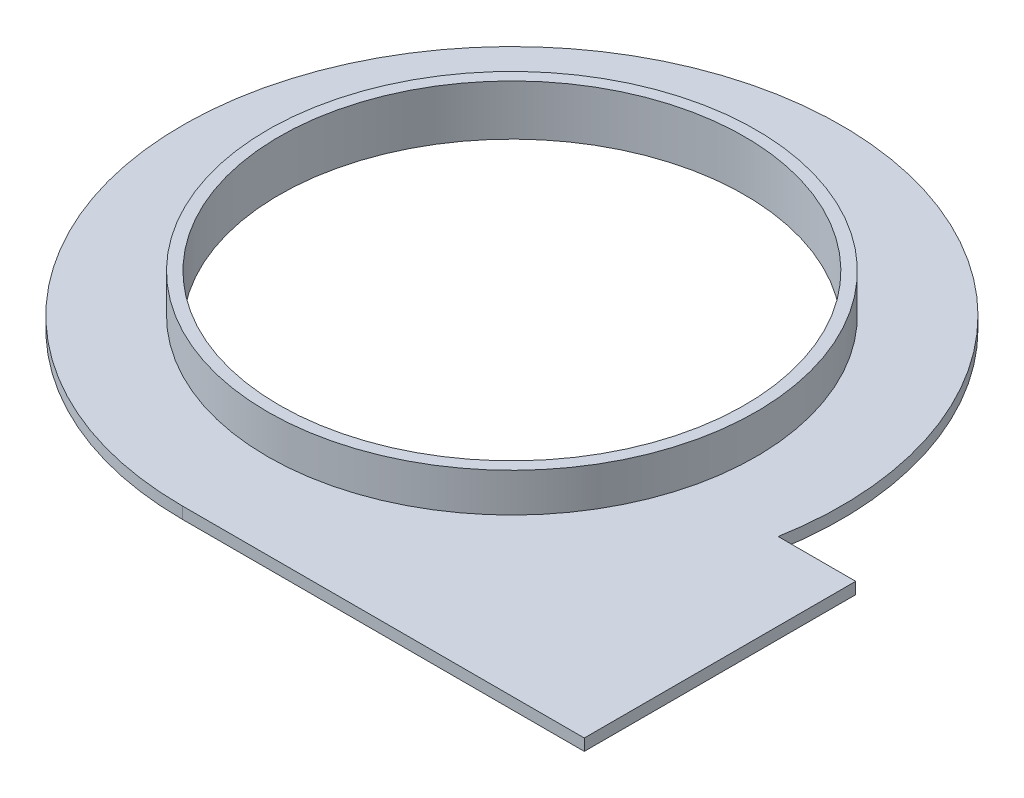
ISO-10303-21;
HEADER;
FILE_DESCRIPTION(('STEP AP214'),'2;1');
FILE_NAME('part.step','',(''),(''),'','','');
FILE_SCHEMA(('AUTOMOTIVE_DESIGN { 1 0 10303 214 1 1 1 1 }'));
ENDSEC;
DATA;
#1=APPLICATION_CONTEXT('core data for automotive mechanical design processes');
#2=APPLICATION_PROTOCOL_DEFINITION('international standard','automotive_design',2000,#1);
#3=PRODUCT_CONTEXT('',#1,'mechanical');
#4=PRODUCT('Part','Part','',(#3));
#5=PRODUCT_RELATED_PRODUCT_CATEGORY('part','',(#4));
#6=PRODUCT_DEFINITION_FORMATION('','',#4);
#7=PRODUCT_DEFINITION_CONTEXT('part definition',#1,'design');
#8=PRODUCT_DEFINITION('design','',#6,#7);
#9=PRODUCT_DEFINITION_SHAPE('','',#8);
#10=(LENGTH_UNIT() NAMED_UNIT(*) SI_UNIT(.MILLI.,.METRE.));
#11=(NAMED_UNIT(*) PLANE_ANGLE_UNIT() SI_UNIT($,.RADIAN.));
#12=(NAMED_UNIT(*) SI_UNIT($,.STERADIAN.) SOLID_ANGLE_UNIT());
#13=UNCERTAINTY_MEASURE_WITH_UNIT(LENGTH_MEASURE(1.E-05),#10,'distance_accuracy_value','');
#14=(GEOMETRIC_REPRESENTATION_CONTEXT(3) GLOBAL_UNCERTAINTY_ASSIGNED_CONTEXT((#13)) GLOBAL_UNIT_ASSIGNED_CONTEXT((#10,
#11,#12)) REPRESENTATION_CONTEXT('',''));
#15=CARTESIAN_POINT('',(0.,0.,0.));
#16=DIRECTION('',(0.,0.,1.));
#17=DIRECTION('',(1.,0.,0.));
#18=AXIS2_PLACEMENT_3D('',#15,#16,#17);
#19=CARTESIAN_POINT('',(0.,3.,0.));
#20=DIRECTION('',(0.,1.,0.));
#21=DIRECTION('',(0.,0.,1.));
#22=AXIS2_PLACEMENT_3D('',#19,#20,#21);
#23=PLANE('',#22);
#24=CARTESIAN_POINT('',(0.,3.,0.));
#25=DIRECTION('',(0.,1.,0.));
#26=DIRECTION('',(0.,0.,1.));
#27=AXIS2_PLACEMENT_3D('',#24,#25,#26);
#28=CIRCLE('',#27,85.);
#29=CARTESIAN_POINT('',(83.6660026534076,3.,15.));
#30=VERTEX_POINT('',#29);
#31=CARTESIAN_POINT('',(0.,3.,85.));
#32=VERTEX_POINT('',#31);
#33=EDGE_CURVE('E92',#30,#32,#28,.T.);
#34=ORIENTED_EDGE('',*,*,#33,.T.);
#35=DIRECTION('',(1.,0.,0.));
#36=VECTOR('',#35,1.);
#37=CARTESIAN_POINT('',(0.,3.,85.));
#38=LINE('',#37,#36);
#39=CARTESIAN_POINT('',(103.666002653408,3.,85.));
#40=VERTEX_POINT('',#39);
#41=EDGE_CURVE('E87',#32,#40,#38,.T.);
#42=ORIENTED_EDGE('',*,*,#41,.T.);
#43=DIRECTION('',(0.,0.,-1.));
#44=VECTOR('',#43,1.);
#45=CARTESIAN_POINT('',(103.666002653408,3.,85.));
#46=LINE('',#45,#44);
#47=CARTESIAN_POINT('',(103.666002653408,3.,15.));
#48=VERTEX_POINT('',#47);
#49=EDGE_CURVE('E90',#40,#48,#46,.T.);
#50=ORIENTED_EDGE('',*,*,#49,.T.);
#51=DIRECTION('',(-1.,0.,0.));
#52=VECTOR('',#51,1.);
#53=CARTESIAN_POINT('',(83.6660026534076,3.,15.));
#54=LINE('',#53,#52);
#55=EDGE_CURVE('E57',#48,#30,#54,.T.);
#56=ORIENTED_EDGE('',*,*,#55,.T.);
#57=EDGE_LOOP('',(#34,#42,#50,#56));
#58=FACE_BOUND('',#57,.T.);
#59=CARTESIAN_POINT('',(0.,3.,0.));
#60=DIRECTION('',(0.,1.,0.));
#61=DIRECTION('',(0.,0.,1.));
#62=AXIS2_PLACEMENT_3D('',#59,#60,#61);
#63=CIRCLE('',#62,63.);
#64=CARTESIAN_POINT('',(0.,3.,63.));
#65=VERTEX_POINT('',#64);
#66=EDGE_CURVE('E134',#65,#65,#63,.T.);
#67=ORIENTED_EDGE('',*,*,#66,.F.);
#68=EDGE_LOOP('',(#67));
#69=FACE_BOUND('',#68,.T.);
#70=ADVANCED_FACE('F39',(#58,#69),#23,.T.);
#71=CARTESIAN_POINT('',(0.,0.,0.));
#72=DIRECTION('',(0.,1.,0.));
#73=DIRECTION('',(0.,0.,1.));
#74=AXIS2_PLACEMENT_3D('',#71,#72,#73);
#75=PLANE('',#74);
#76=CARTESIAN_POINT('',(0.,0.,0.));
#77=DIRECTION('',(0.,1.,0.));
#78=DIRECTION('',(0.,0.,1.));
#79=AXIS2_PLACEMENT_3D('',#76,#77,#78);
#80=CIRCLE('',#79,85.);
#81=CARTESIAN_POINT('',(83.6660026534076,0.,15.));
#82=VERTEX_POINT('',#81);
#83=CARTESIAN_POINT('',(0.,0.,85.));
#84=VERTEX_POINT('',#83);
#85=EDGE_CURVE('E108',#82,#84,#80,.T.);
#86=ORIENTED_EDGE('',*,*,#85,.F.);
#87=DIRECTION('',(-1.,0.,0.));
#88=VECTOR('',#87,1.);
#89=CARTESIAN_POINT('',(83.6660026534076,0.,15.));
#90=LINE('',#89,#88);
#91=CARTESIAN_POINT('',(103.666002653408,0.,15.));
#92=VERTEX_POINT('',#91);
#93=EDGE_CURVE('E80',#92,#82,#90,.T.);
#94=ORIENTED_EDGE('',*,*,#93,.F.);
#95=DIRECTION('',(0.,0.,-1.));
#96=VECTOR('',#95,1.);
#97=CARTESIAN_POINT('',(103.666002653408,0.,85.));
#98=LINE('',#97,#96);
#99=CARTESIAN_POINT('',(103.666002653408,0.,85.));
#100=VERTEX_POINT('',#99);
#101=EDGE_CURVE('E74',#100,#92,#98,.T.);
#102=ORIENTED_EDGE('',*,*,#101,.F.);
#103=DIRECTION('',(1.,0.,0.));
#104=VECTOR('',#103,1.);
#105=CARTESIAN_POINT('',(0.,0.,85.));
#106=LINE('',#105,#104);
#107=EDGE_CURVE('E97',#84,#100,#106,.T.);
#108=ORIENTED_EDGE('',*,*,#107,.F.);
#109=EDGE_LOOP('',(#86,#94,#102,#108));
#110=FACE_BOUND('',#109,.T.);
#111=CARTESIAN_POINT('',(0.,0.,0.));
#112=DIRECTION('',(0.,1.,0.));
#113=DIRECTION('',(0.,0.,1.));
#114=AXIS2_PLACEMENT_3D('',#111,#112,#113);
#115=CIRCLE('',#114,60.);
#116=CARTESIAN_POINT('',(0.,0.,60.));
#117=VERTEX_POINT('',#116);
#118=EDGE_CURVE('E112',#117,#117,#115,.T.);
#119=ORIENTED_EDGE('',*,*,#118,.T.);
#120=EDGE_LOOP('',(#119));
#121=FACE_BOUND('',#120,.T.);
#122=ADVANCED_FACE('F125',(#110,#121),#75,.F.);
#123=CARTESIAN_POINT('',(0.,3.,0.));
#124=DIRECTION('',(0.,-1.,0.));
#125=DIRECTION('',(0.,0.,-1.));
#126=AXIS2_PLACEMENT_3D('',#123,#124,#125);
#127=CYLINDRICAL_SURFACE('',#126,85.);
#128=ORIENTED_EDGE('',*,*,#85,.T.);
#129=DIRECTION('',(0.,-1.,0.));
#130=VECTOR('',#129,1.);
#131=CARTESIAN_POINT('',(0.,3.,85.));
#132=LINE('',#131,#130);
#133=EDGE_CURVE('E11',#32,#84,#132,.T.);
#134=ORIENTED_EDGE('',*,*,#133,.F.);
#135=ORIENTED_EDGE('',*,*,#33,.F.);
#136=DIRECTION('',(0.,-1.,0.));
#137=VECTOR('',#136,1.);
#138=CARTESIAN_POINT('',(83.6660026534076,3.,15.));
#139=LINE('',#138,#137);
#140=EDGE_CURVE('E104',#30,#82,#139,.T.);
#141=ORIENTED_EDGE('',*,*,#140,.T.);
#142=EDGE_LOOP('',(#128,#134,#135,#141));
#143=FACE_BOUND('',#142,.T.);
#144=ADVANCED_FACE('F41',(#143),#127,.T.);
#145=CARTESIAN_POINT('',(0.,3.,85.));
#146=DIRECTION('',(0.,0.,-1.));
#147=DIRECTION('',(-1.,0.,0.));
#148=AXIS2_PLACEMENT_3D('',#145,#146,#147);
#149=PLANE('',#148);
#150=ORIENTED_EDGE('',*,*,#107,.T.);
#151=DIRECTION('',(0.,-1.,0.));
#152=VECTOR('',#151,1.);
#153=CARTESIAN_POINT('',(103.666002653408,3.,85.));
#154=LINE('',#153,#152);
#155=EDGE_CURVE('E49',#40,#100,#154,.T.);
#156=ORIENTED_EDGE('',*,*,#155,.F.);
#157=ORIENTED_EDGE('',*,*,#41,.F.);
#158=ORIENTED_EDGE('',*,*,#133,.T.);
#159=EDGE_LOOP('',(#150,#156,#157,#158));
#160=FACE_BOUND('',#159,.T.);
#161=ADVANCED_FACE('F96',(#160),#149,.F.);
#162=CARTESIAN_POINT('',(103.666002653408,3.,85.));
#163=DIRECTION('',(-1.,0.,0.));
#164=DIRECTION('',(0.,0.,1.));
#165=AXIS2_PLACEMENT_3D('',#162,#163,#164);
#166=PLANE('',#165);
#167=ORIENTED_EDGE('',*,*,#101,.T.);
#168=DIRECTION('',(0.,-1.,0.));
#169=VECTOR('',#168,1.);
#170=CARTESIAN_POINT('',(103.666002653408,3.,15.));
#171=LINE('',#170,#169);
#172=EDGE_CURVE('E99',#48,#92,#171,.T.);
#173=ORIENTED_EDGE('',*,*,#172,.F.);
#174=ORIENTED_EDGE('',*,*,#49,.F.);
#175=ORIENTED_EDGE('',*,*,#155,.T.);
#176=EDGE_LOOP('',(#167,#173,#174,#175));
#177=FACE_BOUND('',#176,.T.);
#178=ADVANCED_FACE('F100',(#177),#166,.F.);
#179=CARTESIAN_POINT('',(83.6660026534076,3.,15.));
#180=DIRECTION('',(0.,0.,1.));
#181=DIRECTION('',(1.,0.,0.));
#182=AXIS2_PLACEMENT_3D('',#179,#180,#181);
#183=PLANE('',#182);
#184=ORIENTED_EDGE('',*,*,#93,.T.);
#185=ORIENTED_EDGE('',*,*,#140,.F.);
#186=ORIENTED_EDGE('',*,*,#55,.F.);
#187=ORIENTED_EDGE('',*,*,#172,.T.);
#188=EDGE_LOOP('',(#184,#185,#186,#187));
#189=FACE_BOUND('',#188,.T.);
#190=ADVANCED_FACE('F122',(#189),#183,.F.);
#191=CARTESIAN_POINT('',(0.,3.,0.));
#192=DIRECTION('',(0.,-1.,0.));
#193=DIRECTION('',(0.,0.,-1.));
#194=AXIS2_PLACEMENT_3D('',#191,#192,#193);
#195=CYLINDRICAL_SURFACE('',#194,60.);
#196=ORIENTED_EDGE('',*,*,#118,.F.);
#197=EDGE_LOOP('',(#196));
#198=FACE_BOUND('',#197,.T.);
#199=CARTESIAN_POINT('',(0.,13.,0.));
#200=DIRECTION('',(0.,1.,0.));
#201=DIRECTION('',(0.,0.,1.));
#202=AXIS2_PLACEMENT_3D('',#199,#200,#201);
#203=CIRCLE('',#202,60.);
#204=CARTESIAN_POINT('',(0.,13.,60.));
#205=VERTEX_POINT('',#204);
#206=EDGE_CURVE('E138',#205,#205,#203,.T.);
#207=ORIENTED_EDGE('',*,*,#206,.T.);
#208=EDGE_LOOP('',(#207));
#209=FACE_BOUND('',#208,.T.);
#210=ADVANCED_FACE('F146',(#198,#209),#195,.F.);
#211=CARTESIAN_POINT('',(0.,13.,0.));
#212=DIRECTION('',(0.,1.,0.));
#213=DIRECTION('',(0.,0.,1.));
#214=AXIS2_PLACEMENT_3D('',#211,#212,#213);
#215=PLANE('',#214);
#216=CARTESIAN_POINT('',(0.,13.,0.));
#217=DIRECTION('',(0.,1.,0.));
#218=DIRECTION('',(0.,0.,1.));
#219=AXIS2_PLACEMENT_3D('',#216,#217,#218);
#220=CIRCLE('',#219,63.);
#221=CARTESIAN_POINT('',(0.,13.,63.));
#222=VERTEX_POINT('',#221);
#223=EDGE_CURVE('E133',#222,#222,#220,.T.);
#224=ORIENTED_EDGE('',*,*,#223,.T.);
#225=EDGE_LOOP('',(#224));
#226=FACE_BOUND('',#225,.T.);
#227=ORIENTED_EDGE('',*,*,#206,.F.);
#228=EDGE_LOOP('',(#227));
#229=FACE_BOUND('',#228,.T.);
#230=ADVANCED_FACE('F148',(#226,#229),#215,.T.);
#231=CARTESIAN_POINT('',(0.,13.,0.));
#232=DIRECTION('',(0.,-1.,0.));
#233=DIRECTION('',(0.,0.,-1.));
#234=AXIS2_PLACEMENT_3D('',#231,#232,#233);
#235=CYLINDRICAL_SURFACE('',#234,63.);
#236=ORIENTED_EDGE('',*,*,#223,.F.);
#237=EDGE_LOOP('',(#236));
#238=FACE_BOUND('',#237,.T.);
#239=ORIENTED_EDGE('',*,*,#66,.T.);
#240=EDGE_LOOP('',(#239));
#241=FACE_BOUND('',#240,.T.);
#242=ADVANCED_FACE('F150',(#238,#241),#235,.T.);
#243=CLOSED_SHELL('',(#70,#122,#144,#161,#178,#190,#210,#230,#242));
#244=MANIFOLD_SOLID_BREP('B2',#243);
#245=ADVANCED_BREP_SHAPE_REPRESENTATION('',(#18,#244),#14);
#246=SHAPE_DEFINITION_REPRESENTATION(#9,#245);
ENDSEC;
END-ISO-10303-21;
